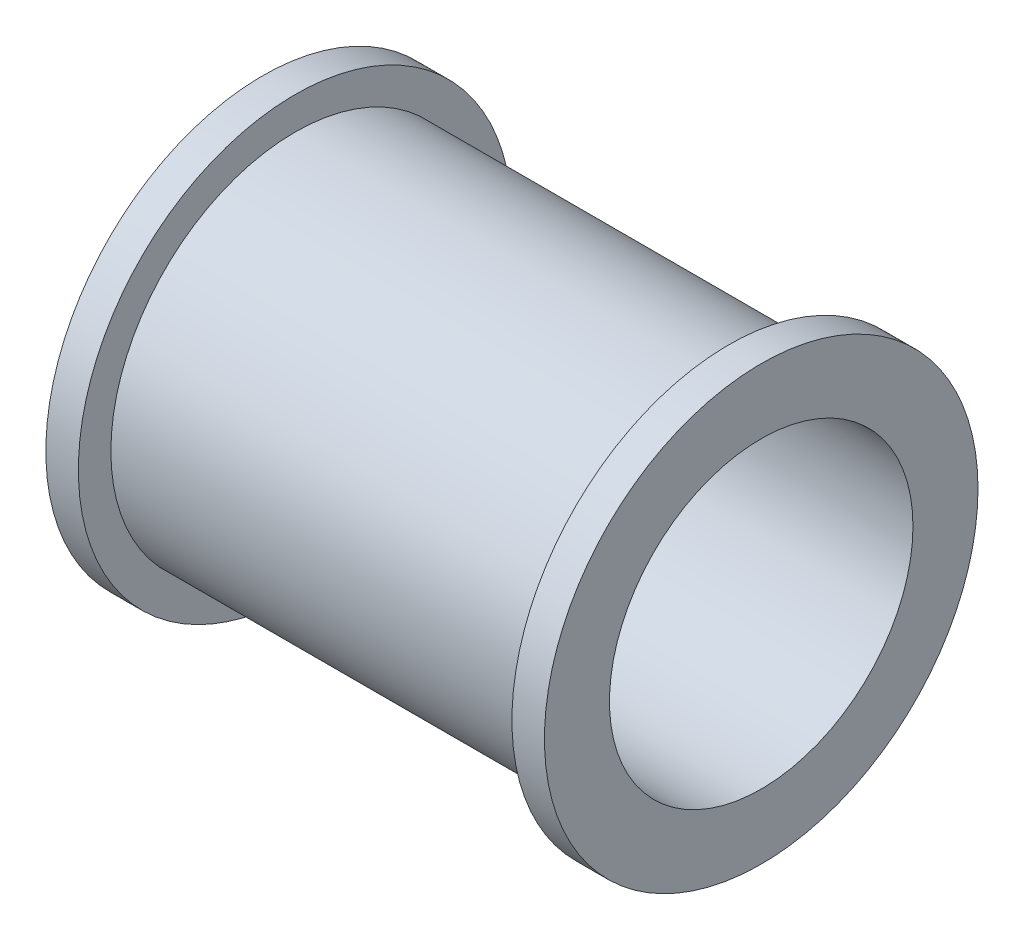
ISO-10303-21;
HEADER;
FILE_DESCRIPTION(('STEP AP214'),'2;1');
FILE_NAME('part.step','',(''),(''),'','','');
FILE_SCHEMA(('AUTOMOTIVE_DESIGN { 1 0 10303 214 1 1 1 1 }'));
ENDSEC;
DATA;
#1=APPLICATION_CONTEXT('core data for automotive mechanical design processes');
#2=APPLICATION_PROTOCOL_DEFINITION('international standard','automotive_design',2000,#1);
#3=PRODUCT_CONTEXT('',#1,'mechanical');
#4=PRODUCT('Part','Part','',(#3));
#5=PRODUCT_RELATED_PRODUCT_CATEGORY('part','',(#4));
#6=PRODUCT_DEFINITION_FORMATION('','',#4);
#7=PRODUCT_DEFINITION_CONTEXT('part definition',#1,'design');
#8=PRODUCT_DEFINITION('design','',#6,#7);
#9=PRODUCT_DEFINITION_SHAPE('','',#8);
#10=(LENGTH_UNIT() NAMED_UNIT(*) SI_UNIT(.MILLI.,.METRE.));
#11=(NAMED_UNIT(*) PLANE_ANGLE_UNIT() SI_UNIT($,.RADIAN.));
#12=(NAMED_UNIT(*) SI_UNIT($,.STERADIAN.) SOLID_ANGLE_UNIT());
#13=UNCERTAINTY_MEASURE_WITH_UNIT(LENGTH_MEASURE(1.E-05),#10,'distance_accuracy_value','');
#14=(GEOMETRIC_REPRESENTATION_CONTEXT(3) GLOBAL_UNCERTAINTY_ASSIGNED_CONTEXT((#13)) GLOBAL_UNIT_ASSIGNED_CONTEXT((#10,
#11,#12)) REPRESENTATION_CONTEXT('',''));
#15=CARTESIAN_POINT('',(0.,0.,0.));
#16=DIRECTION('',(0.,0.,1.));
#17=DIRECTION('',(1.,0.,0.));
#18=AXIS2_PLACEMENT_3D('',#15,#16,#17);
#19=CARTESIAN_POINT('',(0.,0.,0.));
#20=DIRECTION('',(-1.,0.,0.));
#21=DIRECTION('',(0.,0.,1.));
#22=AXIS2_PLACEMENT_3D('',#19,#20,#21);
#23=PLANE('',#22);
#24=CARTESIAN_POINT('',(0.,0.,0.));
#25=DIRECTION('',(1.,0.,0.));
#26=DIRECTION('',(0.,0.,-1.));
#27=AXIS2_PLACEMENT_3D('',#24,#25,#26);
#28=CIRCLE('',#27,7.);
#29=CARTESIAN_POINT('',(0.,0.,-7.));
#30=VERTEX_POINT('',#29);
#31=EDGE_CURVE('E58',#30,#30,#28,.T.);
#32=ORIENTED_EDGE('',*,*,#31,.T.);
#33=EDGE_LOOP('',(#32));
#34=FACE_BOUND('',#33,.T.);
#35=CARTESIAN_POINT('',(0.,0.,0.));
#36=DIRECTION('',(1.,0.,0.));
#37=DIRECTION('',(0.,0.,-1.));
#38=AXIS2_PLACEMENT_3D('',#35,#36,#37);
#39=CIRCLE('',#38,10.);
#40=CARTESIAN_POINT('',(0.,0.,-10.));
#41=VERTEX_POINT('',#40);
#42=EDGE_CURVE('E10',#41,#41,#39,.T.);
#43=ORIENTED_EDGE('',*,*,#42,.F.);
#44=EDGE_LOOP('',(#43));
#45=FACE_BOUND('',#44,.T.);
#46=ADVANCED_FACE('F33',(#34,#45),#23,.T.);
#47=CARTESIAN_POINT('',(23.,0.,0.));
#48=DIRECTION('',(1.,0.,0.));
#49=DIRECTION('',(0.,0.,-1.));
#50=AXIS2_PLACEMENT_3D('',#47,#48,#49);
#51=CYLINDRICAL_SURFACE('',#50,10.);
#52=ORIENTED_EDGE('',*,*,#42,.T.);
#53=EDGE_LOOP('',(#52));
#54=FACE_BOUND('',#53,.T.);
#55=CARTESIAN_POINT('',(1.5,0.,0.));
#56=DIRECTION('',(1.,0.,0.));
#57=DIRECTION('',(0.,0.,-1.));
#58=AXIS2_PLACEMENT_3D('',#55,#56,#57);
#59=CIRCLE('',#58,10.);
#60=CARTESIAN_POINT('',(1.5,0.,-10.));
#61=VERTEX_POINT('',#60);
#62=EDGE_CURVE('E39',#61,#61,#59,.T.);
#63=ORIENTED_EDGE('',*,*,#62,.F.);
#64=EDGE_LOOP('',(#63));
#65=FACE_BOUND('',#64,.T.);
#66=ADVANCED_FACE('F91',(#54,#65),#51,.T.);
#67=CARTESIAN_POINT('',(1.5,0.,-10.));
#68=DIRECTION('',(1.,0.,0.));
#69=DIRECTION('',(0.,0.,-1.));
#70=AXIS2_PLACEMENT_3D('',#67,#68,#69);
#71=PLANE('',#70);
#72=ORIENTED_EDGE('',*,*,#62,.T.);
#73=EDGE_LOOP('',(#72));
#74=FACE_BOUND('',#73,.T.);
#75=CARTESIAN_POINT('',(1.5,0.,0.));
#76=DIRECTION('',(1.,0.,0.));
#77=DIRECTION('',(0.,0.,-1.));
#78=AXIS2_PLACEMENT_3D('',#75,#76,#77);
#79=CIRCLE('',#78,8.5);
#80=CARTESIAN_POINT('',(1.5,0.,-8.5));
#81=VERTEX_POINT('',#80);
#82=EDGE_CURVE('E43',#81,#81,#79,.T.);
#83=ORIENTED_EDGE('',*,*,#82,.F.);
#84=EDGE_LOOP('',(#83));
#85=FACE_BOUND('',#84,.T.);
#86=ADVANCED_FACE('F95',(#74,#85),#71,.T.);
#87=CARTESIAN_POINT('',(23.,0.,0.));
#88=DIRECTION('',(1.,0.,0.));
#89=DIRECTION('',(0.,0.,-1.));
#90=AXIS2_PLACEMENT_3D('',#87,#88,#89);
#91=CYLINDRICAL_SURFACE('',#90,8.5);
#92=ORIENTED_EDGE('',*,*,#82,.T.);
#93=EDGE_LOOP('',(#92));
#94=FACE_BOUND('',#93,.T.);
#95=CARTESIAN_POINT('',(21.5,0.,0.));
#96=DIRECTION('',(1.,0.,0.));
#97=DIRECTION('',(0.,0.,-1.));
#98=AXIS2_PLACEMENT_3D('',#95,#96,#97);
#99=CIRCLE('',#98,8.49999999999999);
#100=CARTESIAN_POINT('',(21.5,0.,-8.5));
#101=VERTEX_POINT('',#100);
#102=EDGE_CURVE('E47',#101,#101,#99,.T.);
#103=ORIENTED_EDGE('',*,*,#102,.F.);
#104=EDGE_LOOP('',(#103));
#105=FACE_BOUND('',#104,.T.);
#106=ADVANCED_FACE('F87',(#94,#105),#91,.T.);
#107=CARTESIAN_POINT('',(21.5,0.,-10.));
#108=DIRECTION('',(-1.,0.,0.));
#109=DIRECTION('',(0.,0.,1.));
#110=AXIS2_PLACEMENT_3D('',#107,#108,#109);
#111=PLANE('',#110);
#112=ORIENTED_EDGE('',*,*,#102,.T.);
#113=EDGE_LOOP('',(#112));
#114=FACE_BOUND('',#113,.T.);
#115=CARTESIAN_POINT('',(21.5,0.,0.));
#116=DIRECTION('',(1.,0.,0.));
#117=DIRECTION('',(0.,0.,-1.));
#118=AXIS2_PLACEMENT_3D('',#115,#116,#117);
#119=CIRCLE('',#118,10.);
#120=CARTESIAN_POINT('',(21.5,0.,-10.));
#121=VERTEX_POINT('',#120);
#122=EDGE_CURVE('E52',#121,#121,#119,.T.);
#123=ORIENTED_EDGE('',*,*,#122,.F.);
#124=EDGE_LOOP('',(#123));
#125=FACE_BOUND('',#124,.T.);
#126=ADVANCED_FACE('F81',(#114,#125),#111,.T.);
#127=CARTESIAN_POINT('',(23.,0.,0.));
#128=DIRECTION('',(1.,0.,0.));
#129=DIRECTION('',(0.,0.,-1.));
#130=AXIS2_PLACEMENT_3D('',#127,#128,#129);
#131=CYLINDRICAL_SURFACE('',#130,10.);
#132=ORIENTED_EDGE('',*,*,#122,.T.);
#133=EDGE_LOOP('',(#132));
#134=FACE_BOUND('',#133,.T.);
#135=CARTESIAN_POINT('',(23.,0.,0.));
#136=DIRECTION('',(1.,0.,0.));
#137=DIRECTION('',(0.,0.,-1.));
#138=AXIS2_PLACEMENT_3D('',#135,#136,#137);
#139=CIRCLE('',#138,10.);
#140=CARTESIAN_POINT('',(23.,0.,-10.));
#141=VERTEX_POINT('',#140);
#142=EDGE_CURVE('E55',#141,#141,#139,.T.);
#143=ORIENTED_EDGE('',*,*,#142,.F.);
#144=EDGE_LOOP('',(#143));
#145=FACE_BOUND('',#144,.T.);
#146=ADVANCED_FACE('F76',(#134,#145),#131,.T.);
#147=CARTESIAN_POINT('',(23.,0.,0.));
#148=DIRECTION('',(1.,0.,0.));
#149=DIRECTION('',(0.,0.,-1.));
#150=AXIS2_PLACEMENT_3D('',#147,#148,#149);
#151=PLANE('',#150);
#152=CARTESIAN_POINT('',(23.,0.,0.));
#153=DIRECTION('',(1.,0.,0.));
#154=DIRECTION('',(0.,0.,-1.));
#155=AXIS2_PLACEMENT_3D('',#152,#153,#154);
#156=CIRCLE('',#155,7.);
#157=CARTESIAN_POINT('',(23.,0.,-7.));
#158=VERTEX_POINT('',#157);
#159=EDGE_CURVE('E59',#158,#158,#156,.T.);
#160=ORIENTED_EDGE('',*,*,#159,.F.);
#161=EDGE_LOOP('',(#160));
#162=FACE_BOUND('',#161,.T.);
#163=ORIENTED_EDGE('',*,*,#142,.T.);
#164=EDGE_LOOP('',(#163));
#165=FACE_BOUND('',#164,.T.);
#166=ADVANCED_FACE('F70',(#162,#165),#151,.T.);
#167=CARTESIAN_POINT('',(0.,0.,0.));
#168=DIRECTION('',(1.,0.,0.));
#169=DIRECTION('',(0.,0.,-1.));
#170=AXIS2_PLACEMENT_3D('',#167,#168,#169);
#171=CYLINDRICAL_SURFACE('',#170,7.);
#172=ORIENTED_EDGE('',*,*,#31,.F.);
#173=EDGE_LOOP('',(#172));
#174=FACE_BOUND('',#173,.T.);
#175=ORIENTED_EDGE('',*,*,#159,.T.);
#176=EDGE_LOOP('',(#175));
#177=FACE_BOUND('',#176,.T.);
#178=ADVANCED_FACE('F67',(#174,#177),#171,.F.);
#179=CLOSED_SHELL('',(#46,#66,#86,#106,#126,#146,#166,#178));
#180=MANIFOLD_SOLID_BREP('B2',#179);
#181=ADVANCED_BREP_SHAPE_REPRESENTATION('',(#18,#180),#14);
#182=SHAPE_DEFINITION_REPRESENTATION(#9,#181);
ENDSEC;
END-ISO-10303-21;
